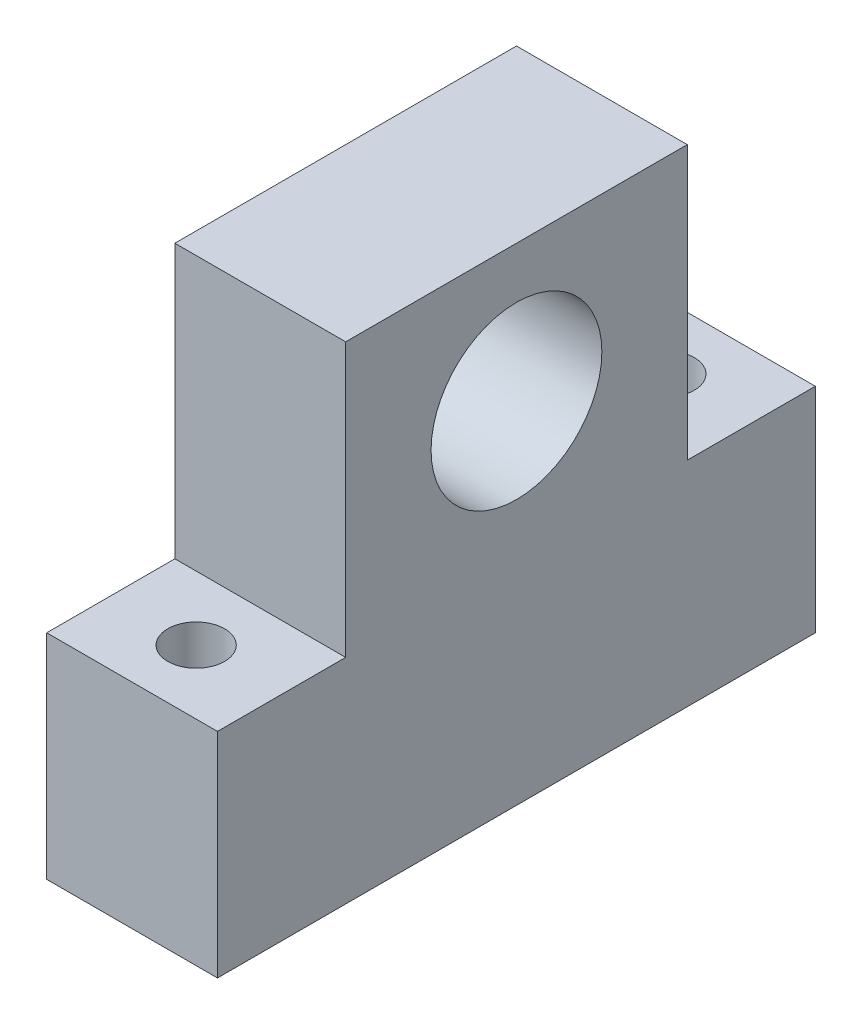
ISO-10303-21;
HEADER;
FILE_DESCRIPTION(('STEP AP214'),'2;1');
FILE_NAME('part.step','',(''),(''),'','','');
FILE_SCHEMA(('AUTOMOTIVE_DESIGN { 1 0 10303 214 1 1 1 1 }'));
ENDSEC;
DATA;
#1=APPLICATION_CONTEXT('core data for automotive mechanical design processes');
#2=APPLICATION_PROTOCOL_DEFINITION('international standard','automotive_design',2000,#1);
#3=PRODUCT_CONTEXT('',#1,'mechanical');
#4=PRODUCT('Part','Part','',(#3));
#5=PRODUCT_RELATED_PRODUCT_CATEGORY('part','',(#4));
#6=PRODUCT_DEFINITION_FORMATION('','',#4);
#7=PRODUCT_DEFINITION_CONTEXT('part definition',#1,'design');
#8=PRODUCT_DEFINITION('design','',#6,#7);
#9=PRODUCT_DEFINITION_SHAPE('','',#8);
#10=(LENGTH_UNIT() NAMED_UNIT(*) SI_UNIT(.MILLI.,.METRE.));
#11=(NAMED_UNIT(*) PLANE_ANGLE_UNIT() SI_UNIT($,.RADIAN.));
#12=(NAMED_UNIT(*) SI_UNIT($,.STERADIAN.) SOLID_ANGLE_UNIT());
#13=UNCERTAINTY_MEASURE_WITH_UNIT(LENGTH_MEASURE(1.E-05),#10,'distance_accuracy_value','');
#14=(GEOMETRIC_REPRESENTATION_CONTEXT(3) GLOBAL_UNCERTAINTY_ASSIGNED_CONTEXT((#13)) GLOBAL_UNIT_ASSIGNED_CONTEXT((#10,
#11,#12)) REPRESENTATION_CONTEXT('',''));
#15=CARTESIAN_POINT('',(0.,0.,0.));
#16=DIRECTION('',(0.,0.,1.));
#17=DIRECTION('',(1.,0.,0.));
#18=AXIS2_PLACEMENT_3D('',#15,#16,#17);
#19=CARTESIAN_POINT('',(0.,15.88,0.));
#20=DIRECTION('',(0.,-1.,0.));
#21=DIRECTION('',(0.,0.,-1.));
#22=AXIS2_PLACEMENT_3D('',#19,#20,#21);
#23=PLANE('',#22);
#24=CARTESIAN_POINT('',(6.35,15.88,-4.765));
#25=DIRECTION('',(0.,1.,0.));
#26=DIRECTION('',(0.,0.,1.));
#27=AXIS2_PLACEMENT_3D('',#24,#25,#26);
#28=CIRCLE('',#27,2.11);
#29=CARTESIAN_POINT('',(6.35,15.88,-2.655));
#30=VERTEX_POINT('',#29);
#31=EDGE_CURVE('E196',#30,#30,#28,.T.);
#32=ORIENTED_EDGE('',*,*,#31,.F.);
#33=EDGE_LOOP('',(#32));
#34=FACE_BOUND('',#33,.T.);
#35=DIRECTION('',(1.,0.,0.));
#36=VECTOR('',#35,1.);
#37=CARTESIAN_POINT('',(12.7,15.88,-9.53));
#38=LINE('',#37,#36);
#39=CARTESIAN_POINT('',(0.,15.88,-9.53));
#40=VERTEX_POINT('',#39);
#41=CARTESIAN_POINT('',(12.7,15.88,-9.53));
#42=VERTEX_POINT('',#41);
#43=EDGE_CURVE('E119',#40,#42,#38,.T.);
#44=ORIENTED_EDGE('',*,*,#43,.F.);
#45=DIRECTION('',(0.,0.,1.));
#46=VECTOR('',#45,1.);
#47=CARTESIAN_POINT('',(0.,15.88,0.));
#48=LINE('',#47,#46);
#49=CARTESIAN_POINT('',(0.,15.88,0.));
#50=VERTEX_POINT('',#49);
#51=EDGE_CURVE('E151',#40,#50,#48,.T.);
#52=ORIENTED_EDGE('',*,*,#51,.T.);
#53=DIRECTION('',(1.,0.,0.));
#54=VECTOR('',#53,1.);
#55=CARTESIAN_POINT('',(0.,15.88,0.));
#56=LINE('',#55,#54);
#57=CARTESIAN_POINT('',(12.7,15.88,0.));
#58=VERTEX_POINT('',#57);
#59=EDGE_CURVE('E147',#50,#58,#56,.T.);
#60=ORIENTED_EDGE('',*,*,#59,.T.);
#61=DIRECTION('',(0.,0.,-1.));
#62=VECTOR('',#61,1.);
#63=CARTESIAN_POINT('',(12.7,15.88,0.));
#64=LINE('',#63,#62);
#65=EDGE_CURVE('E58',#58,#42,#64,.T.);
#66=ORIENTED_EDGE('',*,*,#65,.T.);
#67=EDGE_LOOP('',(#44,#52,#60,#66));
#68=FACE_BOUND('',#67,.T.);
#69=ADVANCED_FACE('F33',(#34,#68),#23,.F.);
#70=CARTESIAN_POINT('',(6.35,15.88,-39.69));
#71=DIRECTION('',(0.,1.,0.));
#72=DIRECTION('',(0.,0.,1.));
#73=AXIS2_PLACEMENT_3D('',#70,#71,#72);
#74=CIRCLE('',#73,2.11);
#75=CARTESIAN_POINT('',(6.35,15.88,-37.58));
#76=VERTEX_POINT('',#75);
#77=EDGE_CURVE('E193',#76,#76,#74,.T.);
#78=ORIENTED_EDGE('',*,*,#77,.F.);
#79=EDGE_LOOP('',(#78));
#80=FACE_BOUND('',#79,.T.);
#81=DIRECTION('',(-1.,0.,0.));
#82=VECTOR('',#81,1.);
#83=CARTESIAN_POINT('',(12.7,15.88,-34.93));
#84=LINE('',#83,#82);
#85=CARTESIAN_POINT('',(12.7,15.88,-34.93));
#86=VERTEX_POINT('',#85);
#87=CARTESIAN_POINT('',(0.,15.88,-34.93));
#88=VERTEX_POINT('',#87);
#89=EDGE_CURVE('E50',#86,#88,#84,.T.);
#90=ORIENTED_EDGE('',*,*,#89,.F.);
#91=CARTESIAN_POINT('',(12.7,15.88,-44.45));
#92=VERTEX_POINT('',#91);
#93=EDGE_CURVE('E123',#86,#92,#64,.T.);
#94=ORIENTED_EDGE('',*,*,#93,.T.);
#95=DIRECTION('',(-1.,0.,0.));
#96=VECTOR('',#95,1.);
#97=CARTESIAN_POINT('',(0.,15.88,-44.45));
#98=LINE('',#97,#96);
#99=CARTESIAN_POINT('',(0.,15.88,-44.45));
#100=VERTEX_POINT('',#99);
#101=EDGE_CURVE('E164',#92,#100,#98,.T.);
#102=ORIENTED_EDGE('',*,*,#101,.T.);
#103=EDGE_CURVE('E154',#100,#88,#48,.T.);
#104=ORIENTED_EDGE('',*,*,#103,.T.);
#105=EDGE_LOOP('',(#90,#94,#102,#104));
#106=FACE_BOUND('',#105,.T.);
#107=ADVANCED_FACE('F220',(#80,#106),#23,.F.);
#108=CARTESIAN_POINT('',(0.,15.88,0.));
#109=DIRECTION('',(1.,0.,0.));
#110=DIRECTION('',(0.,0.,-1.));
#111=AXIS2_PLACEMENT_3D('',#108,#109,#110);
#112=PLANE('',#111);
#113=CARTESIAN_POINT('',(0.,26.04,-22.23));
#114=DIRECTION('',(1.,0.,0.));
#115=DIRECTION('',(0.,0.,-1.));
#116=AXIS2_PLACEMENT_3D('',#113,#114,#115);
#117=CIRCLE('',#116,6.35);
#118=CARTESIAN_POINT('',(0.,26.04,-28.58));
#119=VERTEX_POINT('',#118);
#120=EDGE_CURVE('E189',#119,#119,#117,.T.);
#121=ORIENTED_EDGE('',*,*,#120,.T.);
#122=EDGE_LOOP('',(#121));
#123=FACE_BOUND('',#122,.T.);
#124=DIRECTION('',(0.,0.,1.));
#125=VECTOR('',#124,1.);
#126=CARTESIAN_POINT('',(0.,0.,0.));
#127=LINE('',#126,#125);
#128=CARTESIAN_POINT('',(0.,0.,-44.45));
#129=VERTEX_POINT('',#128);
#130=CARTESIAN_POINT('',(0.,0.,0.));
#131=VERTEX_POINT('',#130);
#132=EDGE_CURVE('E124',#129,#131,#127,.T.);
#133=ORIENTED_EDGE('',*,*,#132,.T.);
#134=DIRECTION('',(0.,-1.,0.));
#135=VECTOR('',#134,1.);
#136=CARTESIAN_POINT('',(0.,15.88,0.));
#137=LINE('',#136,#135);
#138=EDGE_CURVE('E11',#50,#131,#137,.T.);
#139=ORIENTED_EDGE('',*,*,#138,.F.);
#140=ORIENTED_EDGE('',*,*,#51,.F.);
#141=DIRECTION('',(0.,-1.,0.));
#142=VECTOR('',#141,1.);
#143=CARTESIAN_POINT('',(0.,36.2,-9.53));
#144=LINE('',#143,#142);
#145=CARTESIAN_POINT('',(0.,36.2,-9.53));
#146=VERTEX_POINT('',#145);
#147=EDGE_CURVE('E129',#146,#40,#144,.T.);
#148=ORIENTED_EDGE('',*,*,#147,.F.);
#149=DIRECTION('',(0.,0.,1.));
#150=VECTOR('',#149,1.);
#151=CARTESIAN_POINT('',(0.,36.2,-34.93));
#152=LINE('',#151,#150);
#153=CARTESIAN_POINT('',(0.,36.2,-34.93));
#154=VERTEX_POINT('',#153);
#155=EDGE_CURVE('E109',#154,#146,#152,.T.);
#156=ORIENTED_EDGE('',*,*,#155,.F.);
#157=DIRECTION('',(0.,-1.,0.));
#158=VECTOR('',#157,1.);
#159=CARTESIAN_POINT('',(0.,36.2,-34.93));
#160=LINE('',#159,#158);
#161=EDGE_CURVE('E106',#154,#88,#160,.T.);
#162=ORIENTED_EDGE('',*,*,#161,.T.);
#163=ORIENTED_EDGE('',*,*,#103,.F.);
#164=DIRECTION('',(0.,-1.,0.));
#165=VECTOR('',#164,1.);
#166=CARTESIAN_POINT('',(0.,15.88,-44.45));
#167=LINE('',#166,#165);
#168=EDGE_CURVE('E161',#100,#129,#167,.T.);
#169=ORIENTED_EDGE('',*,*,#168,.T.);
#170=EDGE_LOOP('',(#133,#139,#140,#148,#156,#162,#163,#169));
#171=FACE_BOUND('',#170,.T.);
#172=ADVANCED_FACE('F35',(#123,#171),#112,.F.);
#173=CARTESIAN_POINT('',(0.,15.88,0.));
#174=DIRECTION('',(0.,0.,-1.));
#175=DIRECTION('',(-1.,0.,0.));
#176=AXIS2_PLACEMENT_3D('',#173,#174,#175);
#177=PLANE('',#176);
#178=DIRECTION('',(1.,0.,0.));
#179=VECTOR('',#178,1.);
#180=CARTESIAN_POINT('',(0.,0.,0.));
#181=LINE('',#180,#179);
#182=CARTESIAN_POINT('',(12.7,0.,0.));
#183=VERTEX_POINT('',#182);
#184=EDGE_CURVE('E127',#131,#183,#181,.T.);
#185=ORIENTED_EDGE('',*,*,#184,.T.);
#186=DIRECTION('',(0.,-1.,0.));
#187=VECTOR('',#186,1.);
#188=CARTESIAN_POINT('',(12.7,15.88,0.));
#189=LINE('',#188,#187);
#190=EDGE_CURVE('E42',#58,#183,#189,.T.);
#191=ORIENTED_EDGE('',*,*,#190,.F.);
#192=ORIENTED_EDGE('',*,*,#59,.F.);
#193=ORIENTED_EDGE('',*,*,#138,.T.);
#194=EDGE_LOOP('',(#185,#191,#192,#193));
#195=FACE_BOUND('',#194,.T.);
#196=ADVANCED_FACE('F179',(#195),#177,.F.);
#197=CARTESIAN_POINT('',(12.7,15.88,0.));
#198=DIRECTION('',(-1.,0.,0.));
#199=DIRECTION('',(0.,0.,1.));
#200=AXIS2_PLACEMENT_3D('',#197,#198,#199);
#201=PLANE('',#200);
#202=CARTESIAN_POINT('',(12.7,26.04,-22.23));
#203=DIRECTION('',(1.,0.,0.));
#204=DIRECTION('',(0.,0.,-1.));
#205=AXIS2_PLACEMENT_3D('',#202,#203,#204);
#206=CIRCLE('',#205,6.35);
#207=CARTESIAN_POINT('',(12.7,26.04,-28.58));
#208=VERTEX_POINT('',#207);
#209=EDGE_CURVE('E186',#208,#208,#206,.T.);
#210=ORIENTED_EDGE('',*,*,#209,.F.);
#211=EDGE_LOOP('',(#210));
#212=FACE_BOUND('',#211,.T.);
#213=DIRECTION('',(0.,0.,-1.));
#214=VECTOR('',#213,1.);
#215=CARTESIAN_POINT('',(12.7,0.,0.));
#216=LINE('',#215,#214);
#217=CARTESIAN_POINT('',(12.7,0.,-44.45));
#218=VERTEX_POINT('',#217);
#219=EDGE_CURVE('E167',#183,#218,#216,.T.);
#220=ORIENTED_EDGE('',*,*,#219,.T.);
#221=DIRECTION('',(0.,-1.,0.));
#222=VECTOR('',#221,1.);
#223=CARTESIAN_POINT('',(12.7,15.88,-44.45));
#224=LINE('',#223,#222);
#225=EDGE_CURVE('E158',#92,#218,#224,.T.);
#226=ORIENTED_EDGE('',*,*,#225,.F.);
#227=ORIENTED_EDGE('',*,*,#93,.F.);
#228=DIRECTION('',(0.,-1.,0.));
#229=VECTOR('',#228,1.);
#230=CARTESIAN_POINT('',(12.7,36.2,-34.93));
#231=LINE('',#230,#229);
#232=CARTESIAN_POINT('',(12.7,36.2,-34.93));
#233=VERTEX_POINT('',#232);
#234=EDGE_CURVE('E104',#233,#86,#231,.T.);
#235=ORIENTED_EDGE('',*,*,#234,.F.);
#236=DIRECTION('',(0.,0.,-1.));
#237=VECTOR('',#236,1.);
#238=CARTESIAN_POINT('',(12.7,36.2,-34.93));
#239=LINE('',#238,#237);
#240=CARTESIAN_POINT('',(12.7,36.2,-9.53));
#241=VERTEX_POINT('',#240);
#242=EDGE_CURVE('E110',#241,#233,#239,.T.);
#243=ORIENTED_EDGE('',*,*,#242,.F.);
#244=DIRECTION('',(0.,-1.,0.));
#245=VECTOR('',#244,1.);
#246=CARTESIAN_POINT('',(12.7,36.2,-9.53));
#247=LINE('',#246,#245);
#248=EDGE_CURVE('E138',#241,#42,#247,.T.);
#249=ORIENTED_EDGE('',*,*,#248,.T.);
#250=ORIENTED_EDGE('',*,*,#65,.F.);
#251=ORIENTED_EDGE('',*,*,#190,.T.);
#252=EDGE_LOOP('',(#220,#226,#227,#235,#243,#249,#250,#251));
#253=FACE_BOUND('',#252,.T.);
#254=ADVANCED_FACE('F121',(#212,#253),#201,.F.);
#255=CARTESIAN_POINT('',(0.,15.88,-44.45));
#256=DIRECTION('',(0.,0.,1.));
#257=DIRECTION('',(1.,0.,0.));
#258=AXIS2_PLACEMENT_3D('',#255,#256,#257);
#259=PLANE('',#258);
#260=DIRECTION('',(-1.,0.,0.));
#261=VECTOR('',#260,1.);
#262=CARTESIAN_POINT('',(0.,0.,-44.45));
#263=LINE('',#262,#261);
#264=EDGE_CURVE('E165',#218,#129,#263,.T.);
#265=ORIENTED_EDGE('',*,*,#264,.T.);
#266=ORIENTED_EDGE('',*,*,#168,.F.);
#267=ORIENTED_EDGE('',*,*,#101,.F.);
#268=ORIENTED_EDGE('',*,*,#225,.T.);
#269=EDGE_LOOP('',(#265,#266,#267,#268));
#270=FACE_BOUND('',#269,.T.);
#271=ADVANCED_FACE('F208',(#270),#259,.F.);
#272=CARTESIAN_POINT('',(0.,0.,0.));
#273=DIRECTION('',(0.,-1.,0.));
#274=DIRECTION('',(0.,0.,-1.));
#275=AXIS2_PLACEMENT_3D('',#272,#273,#274);
#276=PLANE('',#275);
#277=CARTESIAN_POINT('',(6.35,0.,-4.765));
#278=DIRECTION('',(0.,-1.,0.));
#279=DIRECTION('',(0.,0.,-1.));
#280=AXIS2_PLACEMENT_3D('',#277,#278,#279);
#281=CIRCLE('',#280,2.11);
#282=CARTESIAN_POINT('',(6.35,0.,-6.875));
#283=VERTEX_POINT('',#282);
#284=EDGE_CURVE('E37',#283,#283,#281,.T.);
#285=ORIENTED_EDGE('',*,*,#284,.F.);
#286=EDGE_LOOP('',(#285));
#287=FACE_BOUND('',#286,.T.);
#288=CARTESIAN_POINT('',(6.35,0.,-39.69));
#289=DIRECTION('',(0.,-1.,0.));
#290=DIRECTION('',(0.,0.,-1.));
#291=AXIS2_PLACEMENT_3D('',#288,#289,#290);
#292=CIRCLE('',#291,2.11);
#293=CARTESIAN_POINT('',(6.35,0.,-41.8));
#294=VERTEX_POINT('',#293);
#295=EDGE_CURVE('E190',#294,#294,#292,.T.);
#296=ORIENTED_EDGE('',*,*,#295,.F.);
#297=EDGE_LOOP('',(#296));
#298=FACE_BOUND('',#297,.T.);
#299=ORIENTED_EDGE('',*,*,#132,.F.);
#300=ORIENTED_EDGE('',*,*,#264,.F.);
#301=ORIENTED_EDGE('',*,*,#219,.F.);
#302=ORIENTED_EDGE('',*,*,#184,.F.);
#303=EDGE_LOOP('',(#299,#300,#301,#302));
#304=FACE_BOUND('',#303,.T.);
#305=ADVANCED_FACE('F205',(#287,#298,#304),#276,.T.);
#306=CARTESIAN_POINT('',(12.7,36.2,-34.93));
#307=DIRECTION('',(0.,0.,1.));
#308=DIRECTION('',(1.,0.,0.));
#309=AXIS2_PLACEMENT_3D('',#306,#307,#308);
#310=PLANE('',#309);
#311=ORIENTED_EDGE('',*,*,#89,.T.);
#312=ORIENTED_EDGE('',*,*,#161,.F.);
#313=DIRECTION('',(-1.,0.,0.));
#314=VECTOR('',#313,1.);
#315=CARTESIAN_POINT('',(12.7,36.2,-34.93));
#316=LINE('',#315,#314);
#317=EDGE_CURVE('E100',#233,#154,#316,.T.);
#318=ORIENTED_EDGE('',*,*,#317,.F.);
#319=ORIENTED_EDGE('',*,*,#234,.T.);
#320=EDGE_LOOP('',(#311,#312,#318,#319));
#321=FACE_BOUND('',#320,.T.);
#322=ADVANCED_FACE('F102',(#321),#310,.F.);
#323=CARTESIAN_POINT('',(12.7,36.2,-9.53));
#324=DIRECTION('',(0.,0.,-1.));
#325=DIRECTION('',(-1.,0.,0.));
#326=AXIS2_PLACEMENT_3D('',#323,#324,#325);
#327=PLANE('',#326);
#328=ORIENTED_EDGE('',*,*,#43,.T.);
#329=ORIENTED_EDGE('',*,*,#248,.F.);
#330=DIRECTION('',(1.,0.,0.));
#331=VECTOR('',#330,1.);
#332=CARTESIAN_POINT('',(12.7,36.2,-9.53));
#333=LINE('',#332,#331);
#334=EDGE_CURVE('E115',#146,#241,#333,.T.);
#335=ORIENTED_EDGE('',*,*,#334,.F.);
#336=ORIENTED_EDGE('',*,*,#147,.T.);
#337=EDGE_LOOP('',(#328,#329,#335,#336));
#338=FACE_BOUND('',#337,.T.);
#339=ADVANCED_FACE('F222',(#338),#327,.F.);
#340=CARTESIAN_POINT('',(0.,36.2,0.));
#341=DIRECTION('',(0.,-1.,0.));
#342=DIRECTION('',(0.,0.,-1.));
#343=AXIS2_PLACEMENT_3D('',#340,#341,#342);
#344=PLANE('',#343);
#345=ORIENTED_EDGE('',*,*,#242,.T.);
#346=ORIENTED_EDGE('',*,*,#317,.T.);
#347=ORIENTED_EDGE('',*,*,#155,.T.);
#348=ORIENTED_EDGE('',*,*,#334,.T.);
#349=EDGE_LOOP('',(#345,#346,#347,#348));
#350=FACE_BOUND('',#349,.T.);
#351=ADVANCED_FACE('F113',(#350),#344,.F.);
#352=CARTESIAN_POINT('',(0.,26.04,-22.23));
#353=DIRECTION('',(1.,0.,0.));
#354=DIRECTION('',(0.,0.,-1.));
#355=AXIS2_PLACEMENT_3D('',#352,#353,#354);
#356=CYLINDRICAL_SURFACE('',#355,6.35);
#357=ORIENTED_EDGE('',*,*,#120,.F.);
#358=EDGE_LOOP('',(#357));
#359=FACE_BOUND('',#358,.T.);
#360=ORIENTED_EDGE('',*,*,#209,.T.);
#361=EDGE_LOOP('',(#360));
#362=FACE_BOUND('',#361,.T.);
#363=ADVANCED_FACE('F229',(#359,#362),#356,.F.);
#364=CARTESIAN_POINT('',(6.35,-4.82,-39.69));
#365=DIRECTION('',(0.,1.,0.));
#366=DIRECTION('',(0.,0.,1.));
#367=AXIS2_PLACEMENT_3D('',#364,#365,#366);
#368=CYLINDRICAL_SURFACE('',#367,2.11);
#369=ORIENTED_EDGE('',*,*,#295,.T.);
#370=EDGE_LOOP('',(#369));
#371=FACE_BOUND('',#370,.T.);
#372=ORIENTED_EDGE('',*,*,#77,.T.);
#373=EDGE_LOOP('',(#372));
#374=FACE_BOUND('',#373,.T.);
#375=ADVANCED_FACE('F255',(#371,#374),#368,.F.);
#376=CARTESIAN_POINT('',(6.35,-0.819999999999998,-4.765));
#377=DIRECTION('',(0.,1.,0.));
#378=DIRECTION('',(0.,0.,1.));
#379=AXIS2_PLACEMENT_3D('',#376,#377,#378);
#380=CYLINDRICAL_SURFACE('',#379,2.11);
#381=ORIENTED_EDGE('',*,*,#284,.T.);
#382=EDGE_LOOP('',(#381));
#383=FACE_BOUND('',#382,.T.);
#384=ORIENTED_EDGE('',*,*,#31,.T.);
#385=EDGE_LOOP('',(#384));
#386=FACE_BOUND('',#385,.T.);
#387=ADVANCED_FACE('F203',(#383,#386),#380,.F.);
#388=CLOSED_SHELL('',(#69,#107,#172,#196,#254,#271,#305,#322,#339,#351,#363,#375,#387));
#389=MANIFOLD_SOLID_BREP('B2',#388);
#390=ADVANCED_BREP_SHAPE_REPRESENTATION('',(#18,#389),#14);
#391=SHAPE_DEFINITION_REPRESENTATION(#9,#390);
ENDSEC;
END-ISO-10303-21;
